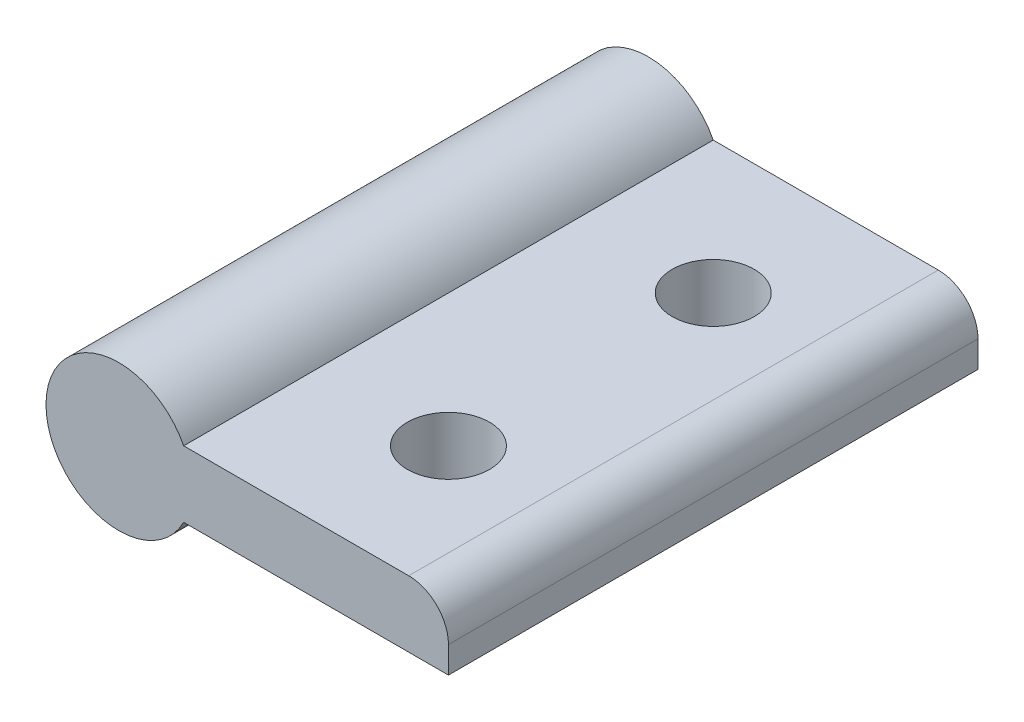
ISO-10303-21;
HEADER;
FILE_DESCRIPTION(('STEP AP214'),'2;1');
FILE_NAME('part.step','',(''),(''),'','','');
FILE_SCHEMA(('AUTOMOTIVE_DESIGN { 1 0 10303 214 1 1 1 1 }'));
ENDSEC;
DATA;
#1=APPLICATION_CONTEXT('core data for automotive mechanical design processes');
#2=APPLICATION_PROTOCOL_DEFINITION('international standard','automotive_design',2000,#1);
#3=PRODUCT_CONTEXT('',#1,'mechanical');
#4=PRODUCT('Part','Part','',(#3));
#5=PRODUCT_RELATED_PRODUCT_CATEGORY('part','',(#4));
#6=PRODUCT_DEFINITION_FORMATION('','',#4);
#7=PRODUCT_DEFINITION_CONTEXT('part definition',#1,'design');
#8=PRODUCT_DEFINITION('design','',#6,#7);
#9=PRODUCT_DEFINITION_SHAPE('','',#8);
#10=(LENGTH_UNIT() NAMED_UNIT(*) SI_UNIT(.MILLI.,.METRE.));
#11=(NAMED_UNIT(*) PLANE_ANGLE_UNIT() SI_UNIT($,.RADIAN.));
#12=(NAMED_UNIT(*) SI_UNIT($,.STERADIAN.) SOLID_ANGLE_UNIT());
#13=UNCERTAINTY_MEASURE_WITH_UNIT(LENGTH_MEASURE(1.E-05),#10,'distance_accuracy_value','');
#14=(GEOMETRIC_REPRESENTATION_CONTEXT(3) GLOBAL_UNCERTAINTY_ASSIGNED_CONTEXT((#13)) GLOBAL_UNIT_ASSIGNED_CONTEXT((#10,
#11,#12)) REPRESENTATION_CONTEXT('',''));
#15=CARTESIAN_POINT('',(0.,0.,0.));
#16=DIRECTION('',(0.,0.,1.));
#17=DIRECTION('',(1.,0.,0.));
#18=AXIS2_PLACEMENT_3D('',#15,#16,#17);
#19=CARTESIAN_POINT('',(0.,0.,0.));
#20=DIRECTION('',(0.,0.,1.));
#21=DIRECTION('',(1.,0.,0.));
#22=AXIS2_PLACEMENT_3D('',#19,#20,#21);
#23=PLANE('',#22);
#24=DIRECTION('',(1.,0.,0.));
#25=VECTOR('',#24,1.);
#26=CARTESIAN_POINT('',(0.,2.5,0.));
#27=LINE('',#26,#25);
#28=CARTESIAN_POINT('',(4.89897948556636,2.5,0.));
#29=VERTEX_POINT('',#28);
#30=CARTESIAN_POINT('',(21.8989794855664,2.5,0.));
#31=VERTEX_POINT('',#30);
#32=EDGE_CURVE('E111',#29,#31,#27,.T.);
#33=ORIENTED_EDGE('',*,*,#32,.T.);
#34=CARTESIAN_POINT('',(21.8989794855664,-0.5,0.));
#35=DIRECTION('',(0.,0.,1.));
#36=DIRECTION('',(1.,0.,0.));
#37=AXIS2_PLACEMENT_3D('',#34,#35,#36);
#38=CIRCLE('',#37,3.);
#39=CARTESIAN_POINT('',(24.8989794855664,-0.5,0.));
#40=VERTEX_POINT('',#39);
#41=EDGE_CURVE('E81',#31,#40,#38,.F.);
#42=ORIENTED_EDGE('',*,*,#41,.T.);
#43=DIRECTION('',(0.,-1.,0.));
#44=VECTOR('',#43,1.);
#45=CARTESIAN_POINT('',(24.8989794855664,0.,0.));
#46=LINE('',#45,#44);
#47=CARTESIAN_POINT('',(24.8989794855664,-2.5,0.));
#48=VERTEX_POINT('',#47);
#49=EDGE_CURVE('E132',#40,#48,#46,.T.);
#50=ORIENTED_EDGE('',*,*,#49,.T.);
#51=DIRECTION('',(1.,0.,0.));
#52=VECTOR('',#51,1.);
#53=CARTESIAN_POINT('',(4.89897948556636,-2.5,0.));
#54=LINE('',#53,#52);
#55=CARTESIAN_POINT('',(4.89897948556636,-2.5,0.));
#56=VERTEX_POINT('',#55);
#57=EDGE_CURVE('E140',#56,#48,#54,.T.);
#58=ORIENTED_EDGE('',*,*,#57,.F.);
#59=CARTESIAN_POINT('',(0.,0.,0.));
#60=DIRECTION('',(0.,0.,1.));
#61=DIRECTION('',(1.,0.,0.));
#62=AXIS2_PLACEMENT_3D('',#59,#60,#61);
#63=CIRCLE('',#62,5.5);
#64=EDGE_CURVE('E130',#29,#56,#63,.T.);
#65=ORIENTED_EDGE('',*,*,#64,.F.);
#66=EDGE_LOOP('',(#33,#42,#50,#58,#65));
#67=FACE_BOUND('',#66,.T.);
#68=ADVANCED_FACE('F59',(#67),#23,.F.);
#69=CARTESIAN_POINT('',(0.,2.5,40.));
#70=DIRECTION('',(0.,1.,0.));
#71=DIRECTION('',(0.,0.,1.));
#72=AXIS2_PLACEMENT_3D('',#69,#70,#71);
#73=PLANE('',#72);
#74=CARTESIAN_POINT('',(14.8989794855664,2.5,10.));
#75=DIRECTION('',(0.,1.,0.));
#76=DIRECTION('',(0.,0.,1.));
#77=AXIS2_PLACEMENT_3D('',#74,#75,#76);
#78=CIRCLE('',#77,3.1);
#79=CARTESIAN_POINT('',(14.8989794855664,2.5,13.1));
#80=VERTEX_POINT('',#79);
#81=EDGE_CURVE('E149',#80,#80,#78,.T.);
#82=ORIENTED_EDGE('',*,*,#81,.F.);
#83=EDGE_LOOP('',(#82));
#84=FACE_BOUND('',#83,.T.);
#85=CARTESIAN_POINT('',(14.8989794855664,2.5,30.));
#86=DIRECTION('',(0.,1.,0.));
#87=DIRECTION('',(0.,0.,1.));
#88=AXIS2_PLACEMENT_3D('',#85,#86,#87);
#89=CIRCLE('',#88,3.1);
#90=CARTESIAN_POINT('',(14.8989794855664,2.5,33.1));
#91=VERTEX_POINT('',#90);
#92=EDGE_CURVE('E229',#91,#91,#89,.T.);
#93=ORIENTED_EDGE('',*,*,#92,.F.);
#94=EDGE_LOOP('',(#93));
#95=FACE_BOUND('',#94,.T.);
#96=DIRECTION('',(1.,0.,0.));
#97=VECTOR('',#96,1.);
#98=CARTESIAN_POINT('',(0.,2.5,40.));
#99=LINE('',#98,#97);
#100=CARTESIAN_POINT('',(4.89897948556636,2.5,40.));
#101=VERTEX_POINT('',#100);
#102=CARTESIAN_POINT('',(21.8989794855664,2.5,40.));
#103=VERTEX_POINT('',#102);
#104=EDGE_CURVE('E109',#101,#103,#99,.T.);
#105=ORIENTED_EDGE('',*,*,#104,.T.);
#106=DIRECTION('',(0.,0.,-1.));
#107=VECTOR('',#106,1.);
#108=CARTESIAN_POINT('',(21.8989794855664,2.5,40.));
#109=LINE('',#108,#107);
#110=EDGE_CURVE('E137',#103,#31,#109,.T.);
#111=ORIENTED_EDGE('',*,*,#110,.T.);
#112=ORIENTED_EDGE('',*,*,#32,.F.);
#113=DIRECTION('',(0.,0.,-1.));
#114=VECTOR('',#113,1.);
#115=CARTESIAN_POINT('',(4.89897948556636,2.5,40.));
#116=LINE('',#115,#114);
#117=EDGE_CURVE('E104',#101,#29,#116,.T.);
#118=ORIENTED_EDGE('',*,*,#117,.F.);
#119=EDGE_LOOP('',(#105,#111,#112,#118));
#120=FACE_BOUND('',#119,.T.);
#121=ADVANCED_FACE('F106',(#84,#95,#120),#73,.T.);
#122=CARTESIAN_POINT('',(24.8989794855664,0.,40.));
#123=DIRECTION('',(1.,0.,0.));
#124=DIRECTION('',(0.,0.,-1.));
#125=AXIS2_PLACEMENT_3D('',#122,#123,#124);
#126=PLANE('',#125);
#127=ORIENTED_EDGE('',*,*,#49,.F.);
#128=DIRECTION('',(0.,0.,-1.));
#129=VECTOR('',#128,1.);
#130=CARTESIAN_POINT('',(24.8989794855664,-0.5,40.));
#131=LINE('',#130,#129);
#132=CARTESIAN_POINT('',(24.8989794855664,-0.5,40.));
#133=VERTEX_POINT('',#132);
#134=EDGE_CURVE('E67',#40,#133,#131,.F.);
#135=ORIENTED_EDGE('',*,*,#134,.T.);
#136=DIRECTION('',(0.,-1.,0.));
#137=VECTOR('',#136,1.);
#138=CARTESIAN_POINT('',(24.8989794855664,0.,40.));
#139=LINE('',#138,#137);
#140=CARTESIAN_POINT('',(24.8989794855664,-2.5,40.));
#141=VERTEX_POINT('',#140);
#142=EDGE_CURVE('E123',#133,#141,#139,.T.);
#143=ORIENTED_EDGE('',*,*,#142,.T.);
#144=DIRECTION('',(0.,0.,-1.));
#145=VECTOR('',#144,1.);
#146=CARTESIAN_POINT('',(24.8989794855664,-2.5,40.));
#147=LINE('',#146,#145);
#148=EDGE_CURVE('E133',#141,#48,#147,.T.);
#149=ORIENTED_EDGE('',*,*,#148,.T.);
#150=EDGE_LOOP('',(#127,#135,#143,#149));
#151=FACE_BOUND('',#150,.T.);
#152=ADVANCED_FACE('F171',(#151),#126,.T.);
#153=CARTESIAN_POINT('',(0.,0.,40.));
#154=DIRECTION('',(0.,0.,1.));
#155=DIRECTION('',(1.,0.,0.));
#156=AXIS2_PLACEMENT_3D('',#153,#154,#155);
#157=PLANE('',#156);
#158=ORIENTED_EDGE('',*,*,#142,.F.);
#159=CARTESIAN_POINT('',(21.8989794855664,-0.5,40.));
#160=DIRECTION('',(0.,0.,1.));
#161=DIRECTION('',(1.,0.,0.));
#162=AXIS2_PLACEMENT_3D('',#159,#160,#161);
#163=CIRCLE('',#162,3.);
#164=EDGE_CURVE('E12',#133,#103,#163,.T.);
#165=ORIENTED_EDGE('',*,*,#164,.T.);
#166=ORIENTED_EDGE('',*,*,#104,.F.);
#167=CARTESIAN_POINT('',(0.,0.,40.));
#168=DIRECTION('',(0.,0.,1.));
#169=DIRECTION('',(1.,0.,0.));
#170=AXIS2_PLACEMENT_3D('',#167,#168,#169);
#171=CIRCLE('',#170,5.5);
#172=CARTESIAN_POINT('',(4.89897948556636,-2.5,40.));
#173=VERTEX_POINT('',#172);
#174=EDGE_CURVE('E118',#101,#173,#171,.T.);
#175=ORIENTED_EDGE('',*,*,#174,.T.);
#176=DIRECTION('',(1.,0.,0.));
#177=VECTOR('',#176,1.);
#178=CARTESIAN_POINT('',(4.89897948556636,-2.5,40.));
#179=LINE('',#178,#177);
#180=EDGE_CURVE('E138',#173,#141,#179,.T.);
#181=ORIENTED_EDGE('',*,*,#180,.T.);
#182=EDGE_LOOP('',(#158,#165,#166,#175,#181));
#183=FACE_BOUND('',#182,.T.);
#184=ADVANCED_FACE('F125',(#183),#157,.T.);
#185=CARTESIAN_POINT('',(0.,0.,40.));
#186=DIRECTION('',(0.,0.,-1.));
#187=DIRECTION('',(-1.,0.,0.));
#188=AXIS2_PLACEMENT_3D('',#185,#186,#187);
#189=CYLINDRICAL_SURFACE('',#188,5.5);
#190=DIRECTION('',(0.,0.,-1.));
#191=VECTOR('',#190,1.);
#192=CARTESIAN_POINT('',(4.89897948556636,-2.5,40.));
#193=LINE('',#192,#191);
#194=EDGE_CURVE('E115',#173,#56,#193,.T.);
#195=ORIENTED_EDGE('',*,*,#194,.F.);
#196=ORIENTED_EDGE('',*,*,#174,.F.);
#197=ORIENTED_EDGE('',*,*,#117,.T.);
#198=ORIENTED_EDGE('',*,*,#64,.T.);
#199=EDGE_LOOP('',(#195,#196,#197,#198));
#200=FACE_BOUND('',#199,.T.);
#201=ADVANCED_FACE('F119',(#200),#189,.T.);
#202=CARTESIAN_POINT('',(4.89897948556636,-2.5,40.));
#203=DIRECTION('',(0.,1.,0.));
#204=DIRECTION('',(0.,0.,1.));
#205=AXIS2_PLACEMENT_3D('',#202,#203,#204);
#206=PLANE('',#205);
#207=CARTESIAN_POINT('',(14.8989794855664,-2.5,10.));
#208=DIRECTION('',(0.,1.,0.));
#209=DIRECTION('',(0.,0.,1.));
#210=AXIS2_PLACEMENT_3D('',#207,#208,#209);
#211=CIRCLE('',#210,3.1);
#212=CARTESIAN_POINT('',(14.8989794855664,-2.5,13.1));
#213=VERTEX_POINT('',#212);
#214=EDGE_CURVE('E143',#213,#213,#211,.T.);
#215=ORIENTED_EDGE('',*,*,#214,.T.);
#216=EDGE_LOOP('',(#215));
#217=FACE_BOUND('',#216,.T.);
#218=CARTESIAN_POINT('',(14.8989794855664,-2.5,30.));
#219=DIRECTION('',(0.,1.,0.));
#220=DIRECTION('',(0.,0.,1.));
#221=AXIS2_PLACEMENT_3D('',#218,#219,#220);
#222=CIRCLE('',#221,3.1);
#223=CARTESIAN_POINT('',(14.8989794855664,-2.5,33.1));
#224=VERTEX_POINT('',#223);
#225=EDGE_CURVE('E146',#224,#224,#222,.T.);
#226=ORIENTED_EDGE('',*,*,#225,.T.);
#227=EDGE_LOOP('',(#226));
#228=FACE_BOUND('',#227,.T.);
#229=ORIENTED_EDGE('',*,*,#57,.T.);
#230=ORIENTED_EDGE('',*,*,#148,.F.);
#231=ORIENTED_EDGE('',*,*,#180,.F.);
#232=ORIENTED_EDGE('',*,*,#194,.T.);
#233=EDGE_LOOP('',(#229,#230,#231,#232));
#234=FACE_BOUND('',#233,.T.);
#235=ADVANCED_FACE('F157',(#217,#228,#234),#206,.F.);
#236=CARTESIAN_POINT('',(14.8989794855664,-7.5,30.));
#237=DIRECTION('',(0.,1.,0.));
#238=DIRECTION('',(0.,0.,1.));
#239=AXIS2_PLACEMENT_3D('',#236,#237,#238);
#240=CYLINDRICAL_SURFACE('',#239,3.1);
#241=ORIENTED_EDGE('',*,*,#92,.T.);
#242=EDGE_LOOP('',(#241));
#243=FACE_BOUND('',#242,.T.);
#244=ORIENTED_EDGE('',*,*,#225,.F.);
#245=EDGE_LOOP('',(#244));
#246=FACE_BOUND('',#245,.T.);
#247=ADVANCED_FACE('F163',(#243,#246),#240,.F.);
#248=CARTESIAN_POINT('',(14.8989794855664,-7.5,10.));
#249=DIRECTION('',(0.,1.,0.));
#250=DIRECTION('',(0.,0.,1.));
#251=AXIS2_PLACEMENT_3D('',#248,#249,#250);
#252=CYLINDRICAL_SURFACE('',#251,3.1);
#253=ORIENTED_EDGE('',*,*,#81,.T.);
#254=EDGE_LOOP('',(#253));
#255=FACE_BOUND('',#254,.T.);
#256=ORIENTED_EDGE('',*,*,#214,.F.);
#257=EDGE_LOOP('',(#256));
#258=FACE_BOUND('',#257,.T.);
#259=ADVANCED_FACE('F159',(#255,#258),#252,.F.);
#260=CARTESIAN_POINT('',(21.8989794855664,-0.5,40.));
#261=DIRECTION('',(0.,0.,-1.));
#262=DIRECTION('',(-1.,0.,0.));
#263=AXIS2_PLACEMENT_3D('',#260,#261,#262);
#264=CYLINDRICAL_SURFACE('',#263,3.);
#265=ORIENTED_EDGE('',*,*,#164,.F.);
#266=ORIENTED_EDGE('',*,*,#134,.F.);
#267=ORIENTED_EDGE('',*,*,#41,.F.);
#268=ORIENTED_EDGE('',*,*,#110,.F.);
#269=EDGE_LOOP('',(#265,#266,#267,#268));
#270=FACE_BOUND('',#269,.T.);
#271=ADVANCED_FACE('F61',(#270),#264,.T.);
#272=CLOSED_SHELL('',(#68,#121,#152,#184,#201,#235,#247,#259,#271));
#273=MANIFOLD_SOLID_BREP('B2',#272);
#274=ADVANCED_BREP_SHAPE_REPRESENTATION('',(#18,#273),#14);
#275=SHAPE_DEFINITION_REPRESENTATION(#9,#274);
ENDSEC;
END-ISO-10303-21;
